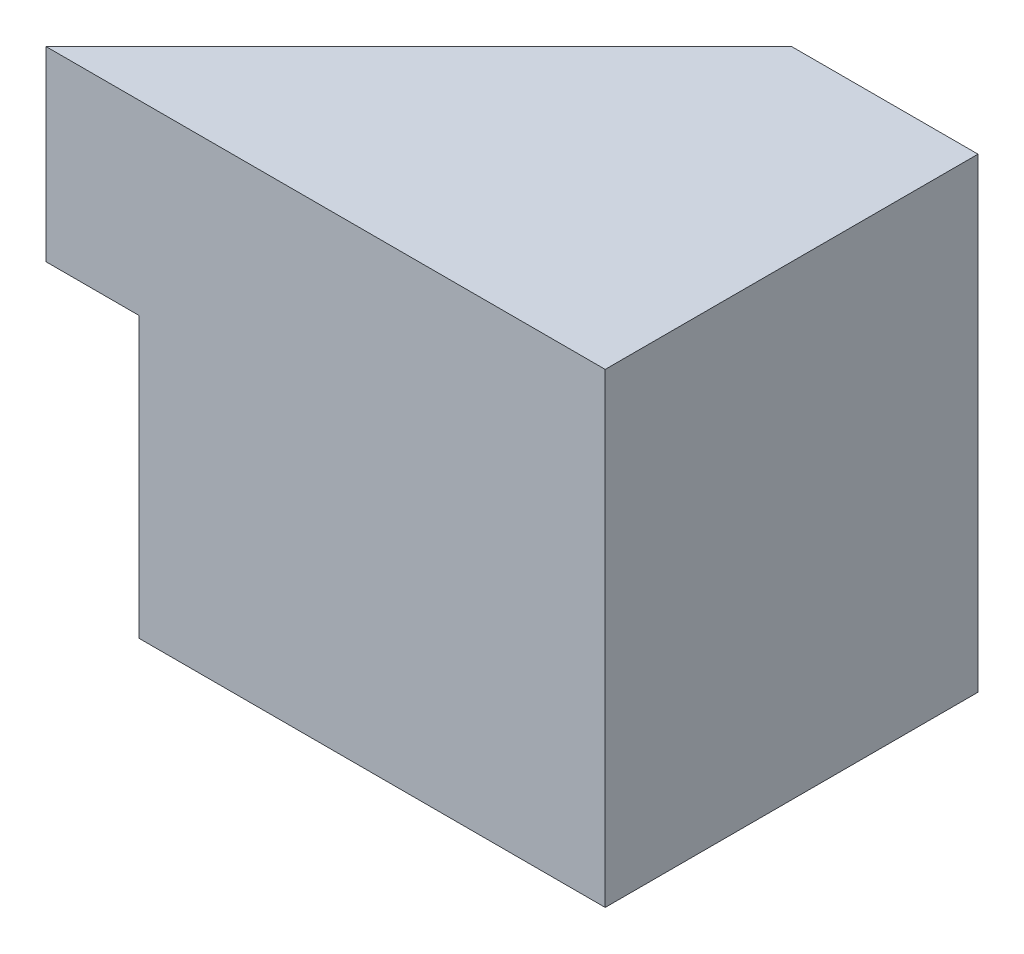
ISO-10303-21;
HEADER;
FILE_DESCRIPTION(('STEP AP214'),'2;1');
FILE_NAME('part.step','',(''),(''),'','','');
FILE_SCHEMA(('AUTOMOTIVE_DESIGN { 1 0 10303 214 1 1 1 1 }'));
ENDSEC;
DATA;
#1=APPLICATION_CONTEXT('core data for automotive mechanical design processes');
#2=APPLICATION_PROTOCOL_DEFINITION('international standard','automotive_design',2000,#1);
#3=PRODUCT_CONTEXT('',#1,'mechanical');
#4=PRODUCT('Part','Part','',(#3));
#5=PRODUCT_RELATED_PRODUCT_CATEGORY('part','',(#4));
#6=PRODUCT_DEFINITION_FORMATION('','',#4);
#7=PRODUCT_DEFINITION_CONTEXT('part definition',#1,'design');
#8=PRODUCT_DEFINITION('design','',#6,#7);
#9=PRODUCT_DEFINITION_SHAPE('','',#8);
#10=(LENGTH_UNIT() NAMED_UNIT(*) SI_UNIT(.MILLI.,.METRE.));
#11=(NAMED_UNIT(*) PLANE_ANGLE_UNIT() SI_UNIT($,.RADIAN.));
#12=(NAMED_UNIT(*) SI_UNIT($,.STERADIAN.) SOLID_ANGLE_UNIT());
#13=UNCERTAINTY_MEASURE_WITH_UNIT(LENGTH_MEASURE(1.E-05),#10,'distance_accuracy_value','');
#14=(GEOMETRIC_REPRESENTATION_CONTEXT(3) GLOBAL_UNCERTAINTY_ASSIGNED_CONTEXT((#13)) GLOBAL_UNIT_ASSIGNED_CONTEXT((#10,
#11,#12)) REPRESENTATION_CONTEXT('',''));
#15=CARTESIAN_POINT('',(0.,0.,0.));
#16=DIRECTION('',(0.,0.,1.));
#17=DIRECTION('',(1.,0.,0.));
#18=AXIS2_PLACEMENT_3D('',#15,#16,#17);
#19=CARTESIAN_POINT('',(0.,5.,0.));
#20=DIRECTION('',(0.,0.,-1.));
#21=DIRECTION('',(-1.,0.,0.));
#22=AXIS2_PLACEMENT_3D('',#19,#20,#21);
#23=PLANE('',#22);
#24=DIRECTION('',(0.,-1.,0.));
#25=VECTOR('',#24,1.);
#26=CARTESIAN_POINT('',(1.,0.,0.));
#27=LINE('',#26,#25);
#28=CARTESIAN_POINT('',(1.,3.,0.));
#29=VERTEX_POINT('',#28);
#30=CARTESIAN_POINT('',(1.,0.,0.));
#31=VERTEX_POINT('',#30);
#32=EDGE_CURVE('E129',#29,#31,#27,.T.);
#33=ORIENTED_EDGE('',*,*,#32,.T.);
#34=DIRECTION('',(1.,0.,0.));
#35=VECTOR('',#34,1.);
#36=CARTESIAN_POINT('',(0.,0.,0.));
#37=LINE('',#36,#35);
#38=CARTESIAN_POINT('',(6.,0.,0.));
#39=VERTEX_POINT('',#38);
#40=EDGE_CURVE('E79',#31,#39,#37,.T.);
#41=ORIENTED_EDGE('',*,*,#40,.T.);
#42=DIRECTION('',(0.,-1.,0.));
#43=VECTOR('',#42,1.);
#44=CARTESIAN_POINT('',(6.,5.,0.));
#45=LINE('',#44,#43);
#46=CARTESIAN_POINT('',(6.,5.,0.));
#47=VERTEX_POINT('',#46);
#48=EDGE_CURVE('E74',#47,#39,#45,.T.);
#49=ORIENTED_EDGE('',*,*,#48,.F.);
#50=DIRECTION('',(1.,0.,0.));
#51=VECTOR('',#50,1.);
#52=CARTESIAN_POINT('',(0.,5.,0.));
#53=LINE('',#52,#51);
#54=CARTESIAN_POINT('',(0.,5.,0.));
#55=VERTEX_POINT('',#54);
#56=EDGE_CURVE('E89',#55,#47,#53,.T.);
#57=ORIENTED_EDGE('',*,*,#56,.F.);
#58=DIRECTION('',(0.,-1.,0.));
#59=VECTOR('',#58,1.);
#60=CARTESIAN_POINT('',(0.,5.,0.));
#61=LINE('',#60,#59);
#62=CARTESIAN_POINT('',(0.,3.,0.));
#63=VERTEX_POINT('',#62);
#64=EDGE_CURVE('E40',#55,#63,#61,.T.);
#65=ORIENTED_EDGE('',*,*,#64,.T.);
#66=DIRECTION('',(1.,0.,0.));
#67=VECTOR('',#66,1.);
#68=CARTESIAN_POINT('',(0.,3.,0.));
#69=LINE('',#68,#67);
#70=EDGE_CURVE('E103',#63,#29,#69,.T.);
#71=ORIENTED_EDGE('',*,*,#70,.T.);
#72=EDGE_LOOP('',(#33,#41,#49,#57,#65,#71));
#73=FACE_BOUND('',#72,.T.);
#74=ADVANCED_FACE('F33',(#73),#23,.F.);
#75=CARTESIAN_POINT('',(0.,5.,-4.));
#76=DIRECTION('',(0.,0.,1.));
#77=DIRECTION('',(1.,0.,0.));
#78=AXIS2_PLACEMENT_3D('',#75,#76,#77);
#79=PLANE('',#78);
#80=DIRECTION('',(-1.,0.,0.));
#81=VECTOR('',#80,1.);
#82=CARTESIAN_POINT('',(4.,3.,-4.));
#83=LINE('',#82,#81);
#84=CARTESIAN_POINT('',(4.,3.,-4.));
#85=VERTEX_POINT('',#84);
#86=CARTESIAN_POINT('',(1.,3.,-4.));
#87=VERTEX_POINT('',#86);
#88=EDGE_CURVE('E126',#85,#87,#83,.T.);
#89=ORIENTED_EDGE('',*,*,#88,.F.);
#90=DIRECTION('',(0.,1.,0.));
#91=VECTOR('',#90,1.);
#92=CARTESIAN_POINT('',(4.,3.,-4.));
#93=LINE('',#92,#91);
#94=CARTESIAN_POINT('',(4.,5.,-4.));
#95=VERTEX_POINT('',#94);
#96=EDGE_CURVE('E127',#85,#95,#93,.T.);
#97=ORIENTED_EDGE('',*,*,#96,.T.);
#98=DIRECTION('',(-1.,0.,0.));
#99=VECTOR('',#98,1.);
#100=CARTESIAN_POINT('',(0.,5.,-4.));
#101=LINE('',#100,#99);
#102=CARTESIAN_POINT('',(6.,5.,-4.));
#103=VERTEX_POINT('',#102);
#104=EDGE_CURVE('E86',#103,#95,#101,.T.);
#105=ORIENTED_EDGE('',*,*,#104,.F.);
#106=DIRECTION('',(0.,-1.,0.));
#107=VECTOR('',#106,1.);
#108=CARTESIAN_POINT('',(6.,5.,-4.));
#109=LINE('',#108,#107);
#110=CARTESIAN_POINT('',(6.,0.,-4.));
#111=VERTEX_POINT('',#110);
#112=EDGE_CURVE('E71',#103,#111,#109,.T.);
#113=ORIENTED_EDGE('',*,*,#112,.T.);
#114=DIRECTION('',(-1.,0.,0.));
#115=VECTOR('',#114,1.);
#116=CARTESIAN_POINT('',(0.,0.,-4.));
#117=LINE('',#116,#115);
#118=CARTESIAN_POINT('',(1.,0.,-4.));
#119=VERTEX_POINT('',#118);
#120=EDGE_CURVE('E78',#111,#119,#117,.T.);
#121=ORIENTED_EDGE('',*,*,#120,.T.);
#122=DIRECTION('',(0.,-1.,0.));
#123=VECTOR('',#122,1.);
#124=CARTESIAN_POINT('',(1.,5.,-4.));
#125=LINE('',#124,#123);
#126=EDGE_CURVE('E47',#87,#119,#125,.T.);
#127=ORIENTED_EDGE('',*,*,#126,.F.);
#128=EDGE_LOOP('',(#89,#97,#105,#113,#121,#127));
#129=FACE_BOUND('',#128,.T.);
#130=ADVANCED_FACE('F84',(#129),#79,.F.);
#131=CARTESIAN_POINT('',(0.,0.,0.));
#132=DIRECTION('',(0.,-1.,0.));
#133=DIRECTION('',(0.,0.,-1.));
#134=AXIS2_PLACEMENT_3D('',#131,#132,#133);
#135=PLANE('',#134);
#136=ORIENTED_EDGE('',*,*,#40,.F.);
#137=DIRECTION('',(0.,0.,-1.));
#138=VECTOR('',#137,1.);
#139=CARTESIAN_POINT('',(1.,0.,0.));
#140=LINE('',#139,#138);
#141=EDGE_CURVE('E11',#31,#119,#140,.T.);
#142=ORIENTED_EDGE('',*,*,#141,.T.);
#143=ORIENTED_EDGE('',*,*,#120,.F.);
#144=DIRECTION('',(0.,0.,-1.));
#145=VECTOR('',#144,1.);
#146=CARTESIAN_POINT('',(6.,0.,0.));
#147=LINE('',#146,#145);
#148=EDGE_CURVE('E68',#39,#111,#147,.T.);
#149=ORIENTED_EDGE('',*,*,#148,.F.);
#150=EDGE_LOOP('',(#136,#142,#143,#149));
#151=FACE_BOUND('',#150,.T.);
#152=ADVANCED_FACE('F88',(#151),#135,.T.);
#153=CARTESIAN_POINT('',(6.,5.,0.));
#154=DIRECTION('',(-1.,0.,0.));
#155=DIRECTION('',(0.,0.,1.));
#156=AXIS2_PLACEMENT_3D('',#153,#154,#155);
#157=PLANE('',#156);
#158=ORIENTED_EDGE('',*,*,#148,.T.);
#159=ORIENTED_EDGE('',*,*,#112,.F.);
#160=DIRECTION('',(0.,0.,-1.));
#161=VECTOR('',#160,1.);
#162=CARTESIAN_POINT('',(6.,5.,0.));
#163=LINE('',#162,#161);
#164=EDGE_CURVE('E55',#47,#103,#163,.T.);
#165=ORIENTED_EDGE('',*,*,#164,.F.);
#166=ORIENTED_EDGE('',*,*,#48,.T.);
#167=EDGE_LOOP('',(#158,#159,#165,#166));
#168=FACE_BOUND('',#167,.T.);
#169=ADVANCED_FACE('F70',(#168),#157,.F.);
#170=CARTESIAN_POINT('',(0.,5.,0.));
#171=DIRECTION('',(0.,-1.,0.));
#172=DIRECTION('',(0.,0.,-1.));
#173=AXIS2_PLACEMENT_3D('',#170,#171,#172);
#174=PLANE('',#173);
#175=ORIENTED_EDGE('',*,*,#104,.T.);
#176=DIRECTION('',(0.707106781186548,0.,-0.707106781186548));
#177=VECTOR('',#176,1.);
#178=CARTESIAN_POINT('',(0.,5.,0.));
#179=LINE('',#178,#177);
#180=EDGE_CURVE('E114',#55,#95,#179,.T.);
#181=ORIENTED_EDGE('',*,*,#180,.F.);
#182=ORIENTED_EDGE('',*,*,#56,.T.);
#183=ORIENTED_EDGE('',*,*,#164,.T.);
#184=EDGE_LOOP('',(#175,#181,#182,#183));
#185=FACE_BOUND('',#184,.T.);
#186=ADVANCED_FACE('F119',(#185),#174,.F.);
#187=CARTESIAN_POINT('',(0.,3.,-5.));
#188=DIRECTION('',(0.,-1.,0.));
#189=DIRECTION('',(0.,0.,-1.));
#190=AXIS2_PLACEMENT_3D('',#187,#188,#189);
#191=PLANE('',#190);
#192=DIRECTION('',(0.707106781186548,0.,-0.707106781186548));
#193=VECTOR('',#192,1.);
#194=CARTESIAN_POINT('',(0.,3.,0.));
#195=LINE('',#194,#193);
#196=CARTESIAN_POINT('',(1.,3.,-1.));
#197=VERTEX_POINT('',#196);
#198=EDGE_CURVE('E117',#63,#197,#195,.T.);
#199=ORIENTED_EDGE('',*,*,#198,.T.);
#200=DIRECTION('',(0.,0.,1.));
#201=VECTOR('',#200,1.);
#202=CARTESIAN_POINT('',(1.,3.,-5.));
#203=LINE('',#202,#201);
#204=EDGE_CURVE('E132',#197,#29,#203,.T.);
#205=ORIENTED_EDGE('',*,*,#204,.T.);
#206=ORIENTED_EDGE('',*,*,#70,.F.);
#207=EDGE_LOOP('',(#199,#205,#206));
#208=FACE_BOUND('',#207,.T.);
#209=ADVANCED_FACE('F152',(#208),#191,.T.);
#210=CARTESIAN_POINT('',(1.,0.,-5.));
#211=DIRECTION('',(-1.,0.,0.));
#212=DIRECTION('',(0.,-1.,0.));
#213=AXIS2_PLACEMENT_3D('',#210,#211,#212);
#214=PLANE('',#213);
#215=ORIENTED_EDGE('',*,*,#126,.T.);
#216=ORIENTED_EDGE('',*,*,#141,.F.);
#217=ORIENTED_EDGE('',*,*,#32,.F.);
#218=ORIENTED_EDGE('',*,*,#204,.F.);
#219=EDGE_CURVE('E133',#87,#197,#203,.T.);
#220=ORIENTED_EDGE('',*,*,#219,.F.);
#221=EDGE_LOOP('',(#215,#216,#217,#218,#220));
#222=FACE_BOUND('',#221,.T.);
#223=ADVANCED_FACE('F153',(#222),#214,.T.);
#224=CARTESIAN_POINT('',(0.,3.,0.));
#225=DIRECTION('',(0.707106781186547,0.,0.707106781186547));
#226=DIRECTION('',(0.707106781186548,0.,-0.707106781186548));
#227=AXIS2_PLACEMENT_3D('',#224,#225,#226);
#228=PLANE('',#227);
#229=ORIENTED_EDGE('',*,*,#180,.T.);
#230=ORIENTED_EDGE('',*,*,#96,.F.);
#231=EDGE_CURVE('E120',#197,#85,#195,.T.);
#232=ORIENTED_EDGE('',*,*,#231,.F.);
#233=ORIENTED_EDGE('',*,*,#198,.F.);
#234=ORIENTED_EDGE('',*,*,#64,.F.);
#235=EDGE_LOOP('',(#229,#230,#232,#233,#234));
#236=FACE_BOUND('',#235,.T.);
#237=ADVANCED_FACE('F112',(#236),#228,.F.);
#238=CARTESIAN_POINT('',(0.,3.,0.));
#239=DIRECTION('',(0.,-1.,0.));
#240=DIRECTION('',(0.,0.,-1.));
#241=AXIS2_PLACEMENT_3D('',#238,#239,#240);
#242=PLANE('',#241);
#243=ORIENTED_EDGE('',*,*,#219,.T.);
#244=ORIENTED_EDGE('',*,*,#231,.T.);
#245=ORIENTED_EDGE('',*,*,#88,.T.);
#246=EDGE_LOOP('',(#243,#244,#245));
#247=FACE_BOUND('',#246,.T.);
#248=ADVANCED_FACE('F149',(#247),#242,.F.);
#249=CLOSED_SHELL('',(#74,#130,#152,#169,#186,#209,#223,#237,#248));
#250=MANIFOLD_SOLID_BREP('B2',#249);
#251=ADVANCED_BREP_SHAPE_REPRESENTATION('',(#18,#250),#14);
#252=SHAPE_DEFINITION_REPRESENTATION(#9,#251);
ENDSEC;
END-ISO-10303-21;
